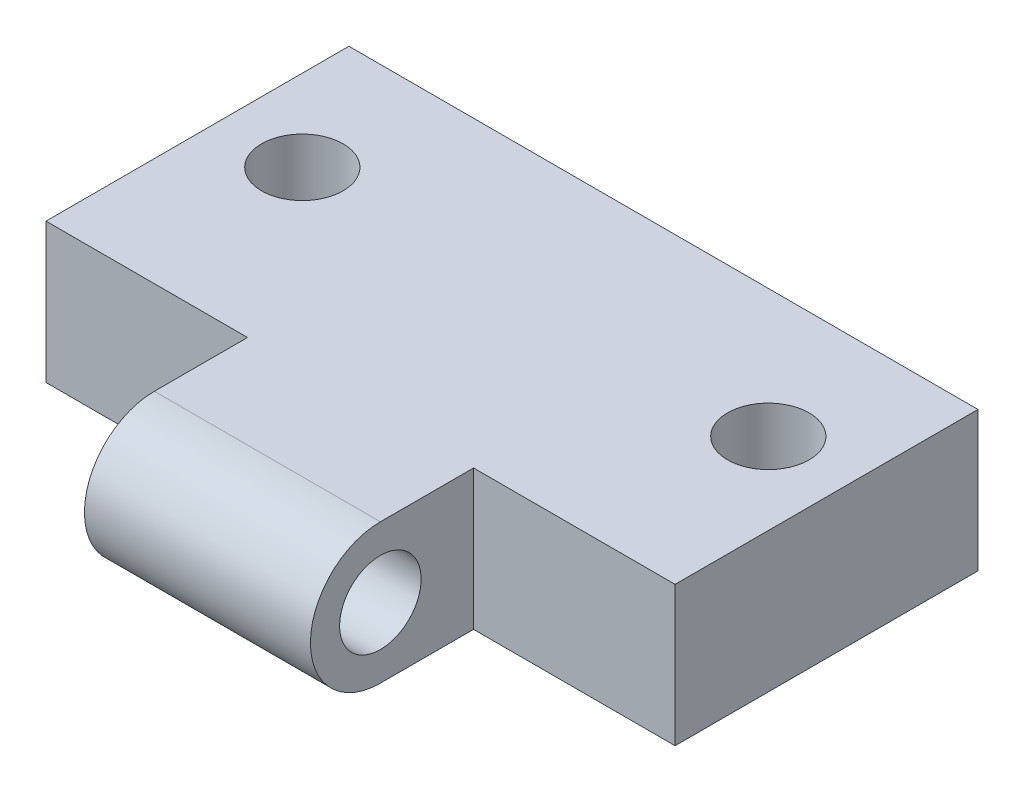
ISO-10303-21;
HEADER;
FILE_DESCRIPTION(('STEP AP214'),'2;1');
FILE_NAME('part.step','',(''),(''),'','','');
FILE_SCHEMA(('AUTOMOTIVE_DESIGN { 1 0 10303 214 1 1 1 1 }'));
ENDSEC;
DATA;
#1=APPLICATION_CONTEXT('core data for automotive mechanical design processes');
#2=APPLICATION_PROTOCOL_DEFINITION('international standard','automotive_design',2000,#1);
#3=PRODUCT_CONTEXT('',#1,'mechanical');
#4=PRODUCT('Part','Part','',(#3));
#5=PRODUCT_RELATED_PRODUCT_CATEGORY('part','',(#4));
#6=PRODUCT_DEFINITION_FORMATION('','',#4);
#7=PRODUCT_DEFINITION_CONTEXT('part definition',#1,'design');
#8=PRODUCT_DEFINITION('design','',#6,#7);
#9=PRODUCT_DEFINITION_SHAPE('','',#8);
#10=(LENGTH_UNIT() NAMED_UNIT(*) SI_UNIT(.MILLI.,.METRE.));
#11=(NAMED_UNIT(*) PLANE_ANGLE_UNIT() SI_UNIT($,.RADIAN.));
#12=(NAMED_UNIT(*) SI_UNIT($,.STERADIAN.) SOLID_ANGLE_UNIT());
#13=UNCERTAINTY_MEASURE_WITH_UNIT(LENGTH_MEASURE(1.E-05),#10,'distance_accuracy_value','');
#14=(GEOMETRIC_REPRESENTATION_CONTEXT(3) GLOBAL_UNCERTAINTY_ASSIGNED_CONTEXT((#13)) GLOBAL_UNIT_ASSIGNED_CONTEXT((#10,
#11,#12)) REPRESENTATION_CONTEXT('',''));
#15=CARTESIAN_POINT('',(0.,0.,0.));
#16=DIRECTION('',(0.,0.,1.));
#17=DIRECTION('',(1.,0.,0.));
#18=AXIS2_PLACEMENT_3D('',#15,#16,#17);
#19=CARTESIAN_POINT('',(3.5,27.,-11.5));
#20=DIRECTION('',(0.,-1.,0.));
#21=DIRECTION('',(0.,0.,-1.));
#22=AXIS2_PLACEMENT_3D('',#19,#20,#21);
#23=CYLINDRICAL_SURFACE('',#22,1.75);
#24=CARTESIAN_POINT('',(3.5,3.,-11.5));
#25=DIRECTION('',(0.,-1.,0.));
#26=DIRECTION('',(0.,0.,-1.));
#27=AXIS2_PLACEMENT_3D('',#24,#25,#26);
#28=CIRCLE('',#27,1.75);
#29=CARTESIAN_POINT('',(3.5,3.,-13.25));
#30=VERTEX_POINT('',#29);
#31=EDGE_CURVE('E164',#30,#30,#28,.T.);
#32=ORIENTED_EDGE('',*,*,#31,.F.);
#33=EDGE_LOOP('',(#32));
#34=FACE_BOUND('',#33,.T.);
#35=CARTESIAN_POINT('',(3.5,0.,-11.5));
#36=DIRECTION('',(0.,-1.,0.));
#37=DIRECTION('',(0.,0.,-1.));
#38=AXIS2_PLACEMENT_3D('',#35,#36,#37);
#39=CIRCLE('',#38,1.75);
#40=CARTESIAN_POINT('',(3.5,0.,-13.25));
#41=VERTEX_POINT('',#40);
#42=EDGE_CURVE('E45',#41,#41,#39,.F.);
#43=ORIENTED_EDGE('',*,*,#42,.F.);
#44=EDGE_LOOP('',(#43));
#45=FACE_BOUND('',#44,.T.);
#46=ADVANCED_FACE('F41',(#34,#45),#23,.F.);
#47=CARTESIAN_POINT('',(23.5,27.,-11.5));
#48=DIRECTION('',(0.,-1.,0.));
#49=DIRECTION('',(0.,0.,-1.));
#50=AXIS2_PLACEMENT_3D('',#47,#48,#49);
#51=CYLINDRICAL_SURFACE('',#50,1.75);
#52=CARTESIAN_POINT('',(23.5,3.,-11.5));
#53=DIRECTION('',(0.,-1.,0.));
#54=DIRECTION('',(0.,0.,-1.));
#55=AXIS2_PLACEMENT_3D('',#52,#53,#54);
#56=CIRCLE('',#55,1.75);
#57=CARTESIAN_POINT('',(23.5,3.,-13.25));
#58=VERTEX_POINT('',#57);
#59=EDGE_CURVE('E145',#58,#58,#56,.T.);
#60=ORIENTED_EDGE('',*,*,#59,.F.);
#61=EDGE_LOOP('',(#60));
#62=FACE_BOUND('',#61,.T.);
#63=CARTESIAN_POINT('',(23.5,0.,-11.5));
#64=DIRECTION('',(0.,-1.,0.));
#65=DIRECTION('',(0.,0.,-1.));
#66=AXIS2_PLACEMENT_3D('',#63,#64,#65);
#67=CIRCLE('',#66,1.75);
#68=CARTESIAN_POINT('',(23.5,0.,-13.25));
#69=VERTEX_POINT('',#68);
#70=EDGE_CURVE('E169',#69,#69,#67,.F.);
#71=ORIENTED_EDGE('',*,*,#70,.F.);
#72=EDGE_LOOP('',(#71));
#73=FACE_BOUND('',#72,.T.);
#74=ADVANCED_FACE('F228',(#62,#73),#51,.F.);
#75=CARTESIAN_POINT('',(27.,0.,0.));
#76=DIRECTION('',(1.,0.,0.));
#77=DIRECTION('',(0.,0.,-1.));
#78=AXIS2_PLACEMENT_3D('',#75,#76,#77);
#79=PLANE('',#78);
#80=DIRECTION('',(0.,-1.,0.));
#81=VECTOR('',#80,1.);
#82=CARTESIAN_POINT('',(27.,27.,-3.99999999999999));
#83=LINE('',#82,#81);
#84=CARTESIAN_POINT('',(27.,3.,-4.));
#85=VERTEX_POINT('',#84);
#86=CARTESIAN_POINT('',(27.,-3.,-4.));
#87=VERTEX_POINT('',#86);
#88=EDGE_CURVE('E66',#85,#87,#83,.T.);
#89=ORIENTED_EDGE('',*,*,#88,.T.);
#90=DIRECTION('',(0.,0.,-1.));
#91=VECTOR('',#90,1.);
#92=CARTESIAN_POINT('',(27.,-3.,0.));
#93=LINE('',#92,#91);
#94=CARTESIAN_POINT('',(27.,-3.,-17.));
#95=VERTEX_POINT('',#94);
#96=EDGE_CURVE('E119',#87,#95,#93,.T.);
#97=ORIENTED_EDGE('',*,*,#96,.T.);
#98=DIRECTION('',(0.,1.,0.));
#99=VECTOR('',#98,1.);
#100=CARTESIAN_POINT('',(27.,-3.,-17.));
#101=LINE('',#100,#99);
#102=CARTESIAN_POINT('',(27.,3.,-17.));
#103=VERTEX_POINT('',#102);
#104=EDGE_CURVE('E130',#95,#103,#101,.T.);
#105=ORIENTED_EDGE('',*,*,#104,.T.);
#106=DIRECTION('',(0.,0.,1.));
#107=VECTOR('',#106,1.);
#108=CARTESIAN_POINT('',(27.,3.,-17.));
#109=LINE('',#108,#107);
#110=EDGE_CURVE('E122',#103,#85,#109,.T.);
#111=ORIENTED_EDGE('',*,*,#110,.T.);
#112=EDGE_LOOP('',(#89,#97,#105,#111));
#113=FACE_BOUND('',#112,.T.);
#114=ADVANCED_FACE('F118',(#113),#79,.T.);
#115=CARTESIAN_POINT('',(0.,0.,0.));
#116=DIRECTION('',(1.,0.,0.));
#117=DIRECTION('',(0.,0.,-1.));
#118=AXIS2_PLACEMENT_3D('',#115,#116,#117);
#119=PLANE('',#118);
#120=DIRECTION('',(0.,0.,-1.));
#121=VECTOR('',#120,1.);
#122=CARTESIAN_POINT('',(0.,-3.,0.));
#123=LINE('',#122,#121);
#124=CARTESIAN_POINT('',(0.,-3.,-4.));
#125=VERTEX_POINT('',#124);
#126=CARTESIAN_POINT('',(0.,-3.,-17.));
#127=VERTEX_POINT('',#126);
#128=EDGE_CURVE('E143',#125,#127,#123,.T.);
#129=ORIENTED_EDGE('',*,*,#128,.F.);
#130=DIRECTION('',(0.,-1.,0.));
#131=VECTOR('',#130,1.);
#132=CARTESIAN_POINT('',(0.,27.,-3.99999999999999));
#133=LINE('',#132,#131);
#134=CARTESIAN_POINT('',(0.,3.,-4.));
#135=VERTEX_POINT('',#134);
#136=EDGE_CURVE('E191',#135,#125,#133,.T.);
#137=ORIENTED_EDGE('',*,*,#136,.F.);
#138=DIRECTION('',(0.,0.,1.));
#139=VECTOR('',#138,1.);
#140=CARTESIAN_POINT('',(0.,3.,-17.));
#141=LINE('',#140,#139);
#142=CARTESIAN_POINT('',(0.,3.,-17.));
#143=VERTEX_POINT('',#142);
#144=EDGE_CURVE('E131',#143,#135,#141,.T.);
#145=ORIENTED_EDGE('',*,*,#144,.F.);
#146=DIRECTION('',(0.,1.,0.));
#147=VECTOR('',#146,1.);
#148=CARTESIAN_POINT('',(0.,-3.,-17.));
#149=LINE('',#148,#147);
#150=EDGE_CURVE('E135',#127,#143,#149,.T.);
#151=ORIENTED_EDGE('',*,*,#150,.F.);
#152=EDGE_LOOP('',(#129,#137,#145,#151));
#153=FACE_BOUND('',#152,.T.);
#154=ADVANCED_FACE('F248',(#153),#119,.F.);
#155=CARTESIAN_POINT('',(27.,0.,0.));
#156=DIRECTION('',(-1.,0.,0.));
#157=DIRECTION('',(0.,0.,1.));
#158=AXIS2_PLACEMENT_3D('',#155,#156,#157);
#159=CYLINDRICAL_SURFACE('',#158,3.);
#160=CARTESIAN_POINT('',(8.65,0.,0.));
#161=DIRECTION('',(1.,0.,0.));
#162=DIRECTION('',(0.,0.,-1.));
#163=AXIS2_PLACEMENT_3D('',#160,#161,#162);
#164=CIRCLE('',#163,3.);
#165=CARTESIAN_POINT('',(8.65,3.,0.));
#166=VERTEX_POINT('',#165);
#167=CARTESIAN_POINT('',(8.65,-3.,0.));
#168=VERTEX_POINT('',#167);
#169=EDGE_CURVE('E138',#166,#168,#164,.T.);
#170=ORIENTED_EDGE('',*,*,#169,.T.);
#171=DIRECTION('',(-1.,0.,0.));
#172=VECTOR('',#171,1.);
#173=CARTESIAN_POINT('',(27.,-3.,0.));
#174=LINE('',#173,#172);
#175=CARTESIAN_POINT('',(18.35,-3.,0.));
#176=VERTEX_POINT('',#175);
#177=EDGE_CURVE('E153',#176,#168,#174,.T.);
#178=ORIENTED_EDGE('',*,*,#177,.F.);
#179=CARTESIAN_POINT('',(18.35,0.,0.));
#180=DIRECTION('',(-1.,0.,0.));
#181=DIRECTION('',(0.,0.,1.));
#182=AXIS2_PLACEMENT_3D('',#179,#180,#181);
#183=CIRCLE('',#182,3.);
#184=CARTESIAN_POINT('',(18.35,3.,0.));
#185=VERTEX_POINT('',#184);
#186=EDGE_CURVE('E163',#176,#185,#183,.T.);
#187=ORIENTED_EDGE('',*,*,#186,.T.);
#188=DIRECTION('',(-1.,0.,0.));
#189=VECTOR('',#188,1.);
#190=CARTESIAN_POINT('',(27.,3.,0.));
#191=LINE('',#190,#189);
#192=EDGE_CURVE('E142',#185,#166,#191,.T.);
#193=ORIENTED_EDGE('',*,*,#192,.T.);
#194=EDGE_LOOP('',(#170,#178,#187,#193));
#195=FACE_BOUND('',#194,.T.);
#196=ADVANCED_FACE('F43',(#195),#159,.T.);
#197=CARTESIAN_POINT('',(27.,-3.,0.));
#198=DIRECTION('',(0.,1.,0.));
#199=DIRECTION('',(0.,0.,1.));
#200=AXIS2_PLACEMENT_3D('',#197,#198,#199);
#201=PLANE('',#200);
#202=CARTESIAN_POINT('',(3.5,-3.,-11.5));
#203=DIRECTION('',(0.,-1.,0.));
#204=DIRECTION('',(0.,0.,-1.));
#205=AXIS2_PLACEMENT_3D('',#202,#203,#204);
#206=CIRCLE('',#205,3.);
#207=CARTESIAN_POINT('',(3.5,-3.,-14.5));
#208=VERTEX_POINT('',#207);
#209=EDGE_CURVE('E176',#208,#208,#206,.T.);
#210=ORIENTED_EDGE('',*,*,#209,.F.);
#211=EDGE_LOOP('',(#210));
#212=FACE_BOUND('',#211,.T.);
#213=CARTESIAN_POINT('',(23.5,-3.,-11.5));
#214=DIRECTION('',(0.,-1.,0.));
#215=DIRECTION('',(0.,0.,-1.));
#216=AXIS2_PLACEMENT_3D('',#213,#214,#215);
#217=CIRCLE('',#216,3.);
#218=CARTESIAN_POINT('',(23.5,-3.,-14.5));
#219=VERTEX_POINT('',#218);
#220=EDGE_CURVE('E181',#219,#219,#217,.T.);
#221=ORIENTED_EDGE('',*,*,#220,.F.);
#222=EDGE_LOOP('',(#221));
#223=FACE_BOUND('',#222,.T.);
#224=ORIENTED_EDGE('',*,*,#177,.T.);
#225=DIRECTION('',(0.,0.,1.));
#226=VECTOR('',#225,1.);
#227=CARTESIAN_POINT('',(8.65,-3.,-4.));
#228=LINE('',#227,#226);
#229=CARTESIAN_POINT('',(8.65,-3.,-4.));
#230=VERTEX_POINT('',#229);
#231=EDGE_CURVE('E123',#230,#168,#228,.T.);
#232=ORIENTED_EDGE('',*,*,#231,.F.);
#233=DIRECTION('',(1.,0.,0.));
#234=VECTOR('',#233,1.);
#235=CARTESIAN_POINT('',(8.65,-3.,-4.));
#236=LINE('',#235,#234);
#237=EDGE_CURVE('E193',#125,#230,#236,.T.);
#238=ORIENTED_EDGE('',*,*,#237,.F.);
#239=ORIENTED_EDGE('',*,*,#128,.T.);
#240=DIRECTION('',(-1.,0.,0.));
#241=VECTOR('',#240,1.);
#242=CARTESIAN_POINT('',(27.,-3.,-17.));
#243=LINE('',#242,#241);
#244=EDGE_CURVE('E128',#95,#127,#243,.T.);
#245=ORIENTED_EDGE('',*,*,#244,.F.);
#246=ORIENTED_EDGE('',*,*,#96,.F.);
#247=DIRECTION('',(1.,0.,0.));
#248=VECTOR('',#247,1.);
#249=CARTESIAN_POINT('',(18.35,-3.,-4.));
#250=LINE('',#249,#248);
#251=CARTESIAN_POINT('',(18.35,-3.,-4.));
#252=VERTEX_POINT('',#251);
#253=EDGE_CURVE('E106',#252,#87,#250,.T.);
#254=ORIENTED_EDGE('',*,*,#253,.F.);
#255=DIRECTION('',(0.,0.,-1.));
#256=VECTOR('',#255,1.);
#257=CARTESIAN_POINT('',(18.35,-3.,-4.));
#258=LINE('',#257,#256);
#259=EDGE_CURVE('E114',#176,#252,#258,.T.);
#260=ORIENTED_EDGE('',*,*,#259,.F.);
#261=EDGE_LOOP('',(#224,#232,#238,#239,#245,#246,#254,#260));
#262=FACE_BOUND('',#261,.T.);
#263=ADVANCED_FACE('F126',(#212,#223,#262),#201,.F.);
#264=CARTESIAN_POINT('',(27.,-3.,-17.));
#265=DIRECTION('',(0.,0.,1.));
#266=DIRECTION('',(1.,0.,0.));
#267=AXIS2_PLACEMENT_3D('',#264,#265,#266);
#268=PLANE('',#267);
#269=ORIENTED_EDGE('',*,*,#150,.T.);
#270=DIRECTION('',(-1.,0.,0.));
#271=VECTOR('',#270,1.);
#272=CARTESIAN_POINT('',(27.,3.,-17.));
#273=LINE('',#272,#271);
#274=EDGE_CURVE('E149',#103,#143,#273,.T.);
#275=ORIENTED_EDGE('',*,*,#274,.F.);
#276=ORIENTED_EDGE('',*,*,#104,.F.);
#277=ORIENTED_EDGE('',*,*,#244,.T.);
#278=EDGE_LOOP('',(#269,#275,#276,#277));
#279=FACE_BOUND('',#278,.T.);
#280=ADVANCED_FACE('F214',(#279),#268,.F.);
#281=CARTESIAN_POINT('',(27.,3.,-17.));
#282=DIRECTION('',(0.,-1.,0.));
#283=DIRECTION('',(0.,0.,-1.));
#284=AXIS2_PLACEMENT_3D('',#281,#282,#283);
#285=PLANE('',#284);
#286=ORIENTED_EDGE('',*,*,#59,.T.);
#287=EDGE_LOOP('',(#286));
#288=FACE_BOUND('',#287,.T.);
#289=ORIENTED_EDGE('',*,*,#31,.T.);
#290=EDGE_LOOP('',(#289));
#291=FACE_BOUND('',#290,.T.);
#292=DIRECTION('',(1.,0.,0.));
#293=VECTOR('',#292,1.);
#294=CARTESIAN_POINT('',(27.,3.,-3.99999999999999));
#295=LINE('',#294,#293);
#296=CARTESIAN_POINT('',(8.65,3.,-3.99999999999999));
#297=VERTEX_POINT('',#296);
#298=EDGE_CURVE('E11',#135,#297,#295,.T.);
#299=ORIENTED_EDGE('',*,*,#298,.T.);
#300=DIRECTION('',(0.,0.,1.));
#301=VECTOR('',#300,1.);
#302=CARTESIAN_POINT('',(8.65,3.,-17.));
#303=LINE('',#302,#301);
#304=EDGE_CURVE('E162',#297,#166,#303,.T.);
#305=ORIENTED_EDGE('',*,*,#304,.T.);
#306=ORIENTED_EDGE('',*,*,#192,.F.);
#307=DIRECTION('',(0.,0.,-1.));
#308=VECTOR('',#307,1.);
#309=CARTESIAN_POINT('',(18.35,3.,-17.));
#310=LINE('',#309,#308);
#311=CARTESIAN_POINT('',(18.35,3.,-3.99999999999999));
#312=VERTEX_POINT('',#311);
#313=EDGE_CURVE('E158',#185,#312,#310,.T.);
#314=ORIENTED_EDGE('',*,*,#313,.T.);
#315=DIRECTION('',(1.,0.,0.));
#316=VECTOR('',#315,1.);
#317=CARTESIAN_POINT('',(27.,3.,-4.));
#318=LINE('',#317,#316);
#319=EDGE_CURVE('E50',#312,#85,#318,.T.);
#320=ORIENTED_EDGE('',*,*,#319,.T.);
#321=ORIENTED_EDGE('',*,*,#110,.F.);
#322=ORIENTED_EDGE('',*,*,#274,.T.);
#323=ORIENTED_EDGE('',*,*,#144,.T.);
#324=EDGE_LOOP('',(#299,#305,#306,#314,#320,#321,#322,#323));
#325=FACE_BOUND('',#324,.T.);
#326=ADVANCED_FACE('F212',(#288,#291,#325),#285,.F.);
#327=CARTESIAN_POINT('',(18.35,27.,-3.99999999999999));
#328=DIRECTION('',(0.,0.,-1.));
#329=DIRECTION('',(0.,1.,0.));
#330=AXIS2_PLACEMENT_3D('',#327,#328,#329);
#331=PLANE('',#330);
#332=DIRECTION('',(0.,-1.,0.));
#333=VECTOR('',#332,1.);
#334=CARTESIAN_POINT('',(18.35,27.,-3.99999999999999));
#335=LINE('',#334,#333);
#336=EDGE_CURVE('E109',#312,#252,#335,.T.);
#337=ORIENTED_EDGE('',*,*,#336,.T.);
#338=ORIENTED_EDGE('',*,*,#253,.T.);
#339=ORIENTED_EDGE('',*,*,#88,.F.);
#340=ORIENTED_EDGE('',*,*,#319,.F.);
#341=EDGE_LOOP('',(#337,#338,#339,#340));
#342=FACE_BOUND('',#341,.T.);
#343=ADVANCED_FACE('F107',(#342),#331,.F.);
#344=CARTESIAN_POINT('',(18.35,27.,-3.99999999999999));
#345=DIRECTION('',(-1.,0.,0.));
#346=DIRECTION('',(0.,0.,1.));
#347=AXIS2_PLACEMENT_3D('',#344,#345,#346);
#348=PLANE('',#347);
#349=CARTESIAN_POINT('',(18.35,0.,0.));
#350=DIRECTION('',(-1.,0.,0.));
#351=DIRECTION('',(0.,0.,1.));
#352=AXIS2_PLACEMENT_3D('',#349,#350,#351);
#353=CIRCLE('',#352,1.75);
#354=CARTESIAN_POINT('',(18.35,0.,1.75));
#355=VERTEX_POINT('',#354);
#356=EDGE_CURVE('E155',#355,#355,#353,.T.);
#357=ORIENTED_EDGE('',*,*,#356,.T.);
#358=EDGE_LOOP('',(#357));
#359=FACE_BOUND('',#358,.T.);
#360=ORIENTED_EDGE('',*,*,#259,.T.);
#361=ORIENTED_EDGE('',*,*,#336,.F.);
#362=ORIENTED_EDGE('',*,*,#313,.F.);
#363=ORIENTED_EDGE('',*,*,#186,.F.);
#364=EDGE_LOOP('',(#360,#361,#362,#363));
#365=FACE_BOUND('',#364,.T.);
#366=ADVANCED_FACE('F210',(#359,#365),#348,.F.);
#367=CARTESIAN_POINT('',(8.65,27.,-3.99999999999999));
#368=DIRECTION('',(0.,0.,-1.));
#369=DIRECTION('',(0.,1.,0.));
#370=AXIS2_PLACEMENT_3D('',#367,#368,#369);
#371=PLANE('',#370);
#372=ORIENTED_EDGE('',*,*,#136,.T.);
#373=ORIENTED_EDGE('',*,*,#237,.T.);
#374=DIRECTION('',(0.,-1.,0.));
#375=VECTOR('',#374,1.);
#376=CARTESIAN_POINT('',(8.65,27.,-3.99999999999999));
#377=LINE('',#376,#375);
#378=EDGE_CURVE('E58',#297,#230,#377,.T.);
#379=ORIENTED_EDGE('',*,*,#378,.F.);
#380=ORIENTED_EDGE('',*,*,#298,.F.);
#381=EDGE_LOOP('',(#372,#373,#379,#380));
#382=FACE_BOUND('',#381,.T.);
#383=ADVANCED_FACE('F241',(#382),#371,.F.);
#384=CARTESIAN_POINT('',(8.65,27.,-3.99999999999999));
#385=DIRECTION('',(1.,0.,0.));
#386=DIRECTION('',(0.,0.,-1.));
#387=AXIS2_PLACEMENT_3D('',#384,#385,#386);
#388=PLANE('',#387);
#389=CARTESIAN_POINT('',(8.65,0.,0.));
#390=DIRECTION('',(1.,0.,0.));
#391=DIRECTION('',(0.,0.,-1.));
#392=AXIS2_PLACEMENT_3D('',#389,#390,#391);
#393=CIRCLE('',#392,1.75);
#394=CARTESIAN_POINT('',(8.65,0.,-1.75));
#395=VERTEX_POINT('',#394);
#396=EDGE_CURVE('E159',#395,#395,#393,.T.);
#397=ORIENTED_EDGE('',*,*,#396,.T.);
#398=EDGE_LOOP('',(#397));
#399=FACE_BOUND('',#398,.T.);
#400=ORIENTED_EDGE('',*,*,#169,.F.);
#401=ORIENTED_EDGE('',*,*,#304,.F.);
#402=ORIENTED_EDGE('',*,*,#378,.T.);
#403=ORIENTED_EDGE('',*,*,#231,.T.);
#404=EDGE_LOOP('',(#400,#401,#402,#403));
#405=FACE_BOUND('',#404,.T.);
#406=ADVANCED_FACE('F207',(#399,#405),#388,.F.);
#407=CARTESIAN_POINT('',(27.,0.,0.));
#408=DIRECTION('',(-1.,0.,0.));
#409=DIRECTION('',(0.,0.,1.));
#410=AXIS2_PLACEMENT_3D('',#407,#408,#409);
#411=CYLINDRICAL_SURFACE('',#410,1.75);
#412=ORIENTED_EDGE('',*,*,#396,.F.);
#413=EDGE_LOOP('',(#412));
#414=FACE_BOUND('',#413,.T.);
#415=ORIENTED_EDGE('',*,*,#356,.F.);
#416=EDGE_LOOP('',(#415));
#417=FACE_BOUND('',#416,.T.);
#418=ADVANCED_FACE('F243',(#414,#417),#411,.F.);
#419=CARTESIAN_POINT('',(23.5,0.,-11.5));
#420=DIRECTION('',(0.,-1.,0.));
#421=DIRECTION('',(0.,0.,-1.));
#422=AXIS2_PLACEMENT_3D('',#419,#420,#421);
#423=PLANE('',#422);
#424=CARTESIAN_POINT('',(23.5,0.,-11.5));
#425=DIRECTION('',(0.,-1.,0.));
#426=DIRECTION('',(0.,0.,-1.));
#427=AXIS2_PLACEMENT_3D('',#424,#425,#426);
#428=CIRCLE('',#427,3.);
#429=CARTESIAN_POINT('',(23.5,0.,-14.5));
#430=VERTEX_POINT('',#429);
#431=EDGE_CURVE('E186',#430,#430,#428,.T.);
#432=ORIENTED_EDGE('',*,*,#431,.T.);
#433=EDGE_LOOP('',(#432));
#434=FACE_BOUND('',#433,.T.);
#435=ORIENTED_EDGE('',*,*,#70,.T.);
#436=EDGE_LOOP('',(#435));
#437=FACE_BOUND('',#436,.T.);
#438=ADVANCED_FACE('F245',(#434,#437),#423,.T.);
#439=CARTESIAN_POINT('',(23.5,0.,-11.5));
#440=DIRECTION('',(0.,-1.,0.));
#441=DIRECTION('',(0.,0.,-1.));
#442=AXIS2_PLACEMENT_3D('',#439,#440,#441);
#443=CYLINDRICAL_SURFACE('',#442,3.);
#444=ORIENTED_EDGE('',*,*,#431,.F.);
#445=EDGE_LOOP('',(#444));
#446=FACE_BOUND('',#445,.T.);
#447=ORIENTED_EDGE('',*,*,#220,.T.);
#448=EDGE_LOOP('',(#447));
#449=FACE_BOUND('',#448,.T.);
#450=ADVANCED_FACE('F271',(#446,#449),#443,.F.);
#451=CARTESIAN_POINT('',(3.5,0.,-11.5));
#452=DIRECTION('',(0.,-1.,0.));
#453=DIRECTION('',(0.,0.,-1.));
#454=AXIS2_PLACEMENT_3D('',#451,#452,#453);
#455=PLANE('',#454);
#456=CARTESIAN_POINT('',(3.5,0.,-11.5));
#457=DIRECTION('',(0.,-1.,0.));
#458=DIRECTION('',(0.,0.,-1.));
#459=AXIS2_PLACEMENT_3D('',#456,#457,#458);
#460=CIRCLE('',#459,3.);
#461=CARTESIAN_POINT('',(3.5,0.,-14.5));
#462=VERTEX_POINT('',#461);
#463=EDGE_CURVE('E171',#462,#462,#460,.T.);
#464=ORIENTED_EDGE('',*,*,#463,.T.);
#465=EDGE_LOOP('',(#464));
#466=FACE_BOUND('',#465,.T.);
#467=ORIENTED_EDGE('',*,*,#42,.T.);
#468=EDGE_LOOP('',(#467));
#469=FACE_BOUND('',#468,.T.);
#470=ADVANCED_FACE('F275',(#466,#469),#455,.T.);
#471=CARTESIAN_POINT('',(3.5,0.,-11.5));
#472=DIRECTION('',(0.,-1.,0.));
#473=DIRECTION('',(0.,0.,-1.));
#474=AXIS2_PLACEMENT_3D('',#471,#472,#473);
#475=CYLINDRICAL_SURFACE('',#474,3.);
#476=ORIENTED_EDGE('',*,*,#463,.F.);
#477=EDGE_LOOP('',(#476));
#478=FACE_BOUND('',#477,.T.);
#479=ORIENTED_EDGE('',*,*,#209,.T.);
#480=EDGE_LOOP('',(#479));
#481=FACE_BOUND('',#480,.T.);
#482=ADVANCED_FACE('F277',(#478,#481),#475,.F.);
#483=CLOSED_SHELL('',(#46,#74,#114,#154,#196,#263,#280,#326,#343,#366,#383,#406,#418,#438,#450,
#470,#482));
#484=MANIFOLD_SOLID_BREP('B2',#483);
#485=ADVANCED_BREP_SHAPE_REPRESENTATION('',(#18,#484),#14);
#486=SHAPE_DEFINITION_REPRESENTATION(#9,#485);
ENDSEC;
END-ISO-10303-21;
